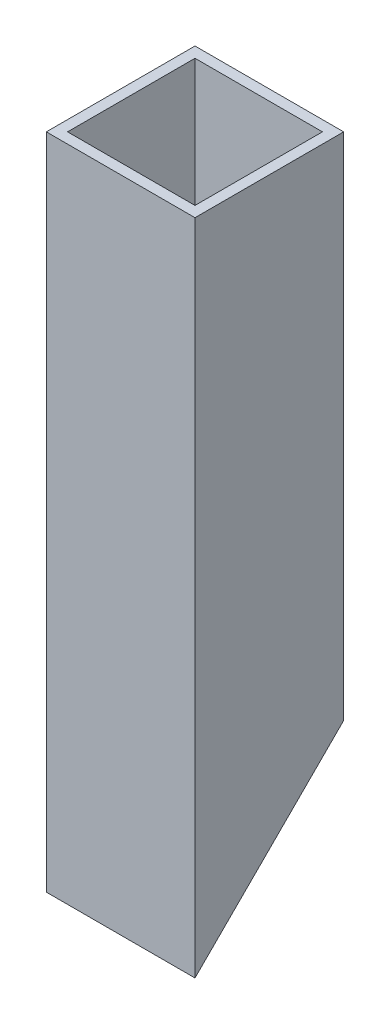
ISO-10303-21;
HEADER;
FILE_DESCRIPTION(('STEP AP214'),'2;1');
FILE_NAME('part.step','',(''),(''),'','','');
FILE_SCHEMA(('AUTOMOTIVE_DESIGN { 1 0 10303 214 1 1 1 1 }'));
ENDSEC;
DATA;
#1=APPLICATION_CONTEXT('core data for automotive mechanical design processes');
#2=APPLICATION_PROTOCOL_DEFINITION('international standard','automotive_design',2000,#1);
#3=PRODUCT_CONTEXT('',#1,'mechanical');
#4=PRODUCT('Part','Part','',(#3));
#5=PRODUCT_RELATED_PRODUCT_CATEGORY('part','',(#4));
#6=PRODUCT_DEFINITION_FORMATION('','',#4);
#7=PRODUCT_DEFINITION_CONTEXT('part definition',#1,'design');
#8=PRODUCT_DEFINITION('design','',#6,#7);
#9=PRODUCT_DEFINITION_SHAPE('','',#8);
#10=(LENGTH_UNIT() NAMED_UNIT(*) SI_UNIT(.MILLI.,.METRE.));
#11=(NAMED_UNIT(*) PLANE_ANGLE_UNIT() SI_UNIT($,.RADIAN.));
#12=(NAMED_UNIT(*) SI_UNIT($,.STERADIAN.) SOLID_ANGLE_UNIT());
#13=UNCERTAINTY_MEASURE_WITH_UNIT(LENGTH_MEASURE(1.E-05),#10,'distance_accuracy_value','');
#14=(GEOMETRIC_REPRESENTATION_CONTEXT(3) GLOBAL_UNCERTAINTY_ASSIGNED_CONTEXT((#13)) GLOBAL_UNIT_ASSIGNED_CONTEXT((#10,
#11,#12)) REPRESENTATION_CONTEXT('',''));
#15=CARTESIAN_POINT('',(0.,0.,0.));
#16=DIRECTION('',(0.,0.,1.));
#17=DIRECTION('',(1.,0.,0.));
#18=AXIS2_PLACEMENT_3D('',#15,#16,#17);
#19=CARTESIAN_POINT('',(0.,196.85,0.));
#20=DIRECTION('',(0.,-1.,0.));
#21=DIRECTION('',(0.,0.,1.));
#22=AXIS2_PLACEMENT_3D('',#19,#20,#21);
#23=PLANE('',#22);
#24=DIRECTION('',(0.,0.,-1.));
#25=VECTOR('',#24,1.);
#26=CARTESIAN_POINT('',(0.,196.85,0.));
#27=LINE('',#26,#25);
#28=CARTESIAN_POINT('',(0.,196.85,44.45));
#29=VERTEX_POINT('',#28);
#30=CARTESIAN_POINT('',(0.,196.85,0.));
#31=VERTEX_POINT('',#30);
#32=EDGE_CURVE('E114',#29,#31,#27,.T.);
#33=ORIENTED_EDGE('',*,*,#32,.F.);
#34=DIRECTION('',(-1.,0.,0.));
#35=VECTOR('',#34,1.);
#36=CARTESIAN_POINT('',(0.,196.85,44.45));
#37=LINE('',#36,#35);
#38=CARTESIAN_POINT('',(44.45,196.85,44.45));
#39=VERTEX_POINT('',#38);
#40=EDGE_CURVE('E123',#39,#29,#37,.T.);
#41=ORIENTED_EDGE('',*,*,#40,.F.);
#42=DIRECTION('',(0.,0.,1.));
#43=VECTOR('',#42,1.);
#44=CARTESIAN_POINT('',(44.45,196.85,0.));
#45=LINE('',#44,#43);
#46=CARTESIAN_POINT('',(44.45,196.85,0.));
#47=VERTEX_POINT('',#46);
#48=EDGE_CURVE('E120',#47,#39,#45,.T.);
#49=ORIENTED_EDGE('',*,*,#48,.F.);
#50=DIRECTION('',(1.,0.,0.));
#51=VECTOR('',#50,1.);
#52=CARTESIAN_POINT('',(0.,196.85,0.));
#53=LINE('',#52,#51);
#54=EDGE_CURVE('E117',#31,#47,#53,.T.);
#55=ORIENTED_EDGE('',*,*,#54,.F.);
#56=EDGE_LOOP('',(#33,#41,#49,#55));
#57=FACE_BOUND('',#56,.T.);
#58=DIRECTION('',(1.,0.,0.));
#59=VECTOR('',#58,1.);
#60=CARTESIAN_POINT('',(3.175,196.85,3.175));
#61=LINE('',#60,#59);
#62=CARTESIAN_POINT('',(3.175,196.85,3.175));
#63=VERTEX_POINT('',#62);
#64=CARTESIAN_POINT('',(41.275,196.85,3.175));
#65=VERTEX_POINT('',#64);
#66=EDGE_CURVE('E98',#63,#65,#61,.T.);
#67=ORIENTED_EDGE('',*,*,#66,.T.);
#68=DIRECTION('',(0.,0.,1.));
#69=VECTOR('',#68,1.);
#70=CARTESIAN_POINT('',(41.275,196.85,3.175));
#71=LINE('',#70,#69);
#72=CARTESIAN_POINT('',(41.275,196.85,41.275));
#73=VERTEX_POINT('',#72);
#74=EDGE_CURVE('E86',#65,#73,#71,.T.);
#75=ORIENTED_EDGE('',*,*,#74,.T.);
#76=DIRECTION('',(-1.,0.,0.));
#77=VECTOR('',#76,1.);
#78=CARTESIAN_POINT('',(3.175,196.85,41.275));
#79=LINE('',#78,#77);
#80=CARTESIAN_POINT('',(3.175,196.85,41.275));
#81=VERTEX_POINT('',#80);
#82=EDGE_CURVE('E109',#73,#81,#79,.T.);
#83=ORIENTED_EDGE('',*,*,#82,.T.);
#84=DIRECTION('',(0.,0.,-1.));
#85=VECTOR('',#84,1.);
#86=CARTESIAN_POINT('',(3.175,196.85,3.175));
#87=LINE('',#86,#85);
#88=EDGE_CURVE('E105',#81,#63,#87,.T.);
#89=ORIENTED_EDGE('',*,*,#88,.T.);
#90=EDGE_LOOP('',(#67,#75,#83,#89));
#91=FACE_BOUND('',#90,.T.);
#92=ADVANCED_FACE('F37',(#57,#91),#23,.F.);
#93=CARTESIAN_POINT('',(0.,196.85,0.));
#94=DIRECTION('',(1.,0.,0.));
#95=DIRECTION('',(0.,0.,1.));
#96=AXIS2_PLACEMENT_3D('',#93,#94,#95);
#97=PLANE('',#96);
#98=DIRECTION('',(0.,-1.,0.));
#99=VECTOR('',#98,1.);
#100=CARTESIAN_POINT('',(0.,196.85,44.45));
#101=LINE('',#100,#99);
#102=CARTESIAN_POINT('',(0.,0.,44.45));
#103=VERTEX_POINT('',#102);
#104=EDGE_CURVE('E126',#29,#103,#101,.T.);
#105=ORIENTED_EDGE('',*,*,#104,.F.);
#106=ORIENTED_EDGE('',*,*,#32,.T.);
#107=DIRECTION('',(0.,-1.,0.));
#108=VECTOR('',#107,1.);
#109=CARTESIAN_POINT('',(0.,196.85,0.));
#110=LINE('',#109,#108);
#111=CARTESIAN_POINT('',(0.,44.45,0.));
#112=VERTEX_POINT('',#111);
#113=EDGE_CURVE('E136',#31,#112,#110,.T.);
#114=ORIENTED_EDGE('',*,*,#113,.T.);
#115=DIRECTION('',(0.,0.707106781186546,-0.707106781186549));
#116=VECTOR('',#115,1.);
#117=CARTESIAN_POINT('',(0.,44.45,0.));
#118=LINE('',#117,#116);
#119=EDGE_CURVE('E11',#103,#112,#118,.T.);
#120=ORIENTED_EDGE('',*,*,#119,.F.);
#121=EDGE_LOOP('',(#105,#106,#114,#120));
#122=FACE_BOUND('',#121,.T.);
#123=ADVANCED_FACE('F172',(#122),#97,.F.);
#124=CARTESIAN_POINT('',(0.,196.85,0.));
#125=DIRECTION('',(0.,0.,1.));
#126=DIRECTION('',(-1.,0.,0.));
#127=AXIS2_PLACEMENT_3D('',#124,#125,#126);
#128=PLANE('',#127);
#129=ORIENTED_EDGE('',*,*,#113,.F.);
#130=ORIENTED_EDGE('',*,*,#54,.T.);
#131=DIRECTION('',(0.,-1.,0.));
#132=VECTOR('',#131,1.);
#133=CARTESIAN_POINT('',(44.45,196.85,0.));
#134=LINE('',#133,#132);
#135=CARTESIAN_POINT('',(44.45,44.45,0.));
#136=VERTEX_POINT('',#135);
#137=EDGE_CURVE('E134',#47,#136,#134,.T.);
#138=ORIENTED_EDGE('',*,*,#137,.T.);
#139=DIRECTION('',(1.,0.,0.));
#140=VECTOR('',#139,1.);
#141=CARTESIAN_POINT('',(44.45,44.45,0.));
#142=LINE('',#141,#140);
#143=EDGE_CURVE('E56',#112,#136,#142,.T.);
#144=ORIENTED_EDGE('',*,*,#143,.F.);
#145=EDGE_LOOP('',(#129,#130,#138,#144));
#146=FACE_BOUND('',#145,.T.);
#147=ADVANCED_FACE('F180',(#146),#128,.F.);
#148=CARTESIAN_POINT('',(44.45,196.85,0.));
#149=DIRECTION('',(-1.,0.,0.));
#150=DIRECTION('',(0.,0.,-1.));
#151=AXIS2_PLACEMENT_3D('',#148,#149,#150);
#152=PLANE('',#151);
#153=ORIENTED_EDGE('',*,*,#137,.F.);
#154=ORIENTED_EDGE('',*,*,#48,.T.);
#155=DIRECTION('',(0.,-1.,0.));
#156=VECTOR('',#155,1.);
#157=CARTESIAN_POINT('',(44.45,196.85,44.45));
#158=LINE('',#157,#156);
#159=CARTESIAN_POINT('',(44.45,0.,44.45));
#160=VERTEX_POINT('',#159);
#161=EDGE_CURVE('E131',#39,#160,#158,.T.);
#162=ORIENTED_EDGE('',*,*,#161,.T.);
#163=DIRECTION('',(0.,-0.707106781186546,0.707106781186549));
#164=VECTOR('',#163,1.);
#165=CARTESIAN_POINT('',(44.45,44.45,0.));
#166=LINE('',#165,#164);
#167=EDGE_CURVE('E47',#136,#160,#166,.T.);
#168=ORIENTED_EDGE('',*,*,#167,.F.);
#169=EDGE_LOOP('',(#153,#154,#162,#168));
#170=FACE_BOUND('',#169,.T.);
#171=ADVANCED_FACE('F182',(#170),#152,.F.);
#172=CARTESIAN_POINT('',(0.,196.85,44.45));
#173=DIRECTION('',(0.,0.,-1.));
#174=DIRECTION('',(1.,0.,0.));
#175=AXIS2_PLACEMENT_3D('',#172,#173,#174);
#176=PLANE('',#175);
#177=DIRECTION('',(-1.,0.,0.));
#178=VECTOR('',#177,1.);
#179=CARTESIAN_POINT('',(0.,0.,44.45));
#180=LINE('',#179,#178);
#181=EDGE_CURVE('E90',#160,#103,#180,.T.);
#182=ORIENTED_EDGE('',*,*,#181,.F.);
#183=ORIENTED_EDGE('',*,*,#161,.F.);
#184=ORIENTED_EDGE('',*,*,#40,.T.);
#185=ORIENTED_EDGE('',*,*,#104,.T.);
#186=EDGE_LOOP('',(#182,#183,#184,#185));
#187=FACE_BOUND('',#186,.T.);
#188=ADVANCED_FACE('F173',(#187),#176,.F.);
#189=CARTESIAN_POINT('',(3.175,196.85,3.175));
#190=DIRECTION('',(0.,0.,1.));
#191=DIRECTION('',(-1.,0.,0.));
#192=AXIS2_PLACEMENT_3D('',#189,#190,#191);
#193=PLANE('',#192);
#194=DIRECTION('',(1.,0.,0.));
#195=VECTOR('',#194,1.);
#196=CARTESIAN_POINT('',(0.,41.275,3.175));
#197=LINE('',#196,#195);
#198=CARTESIAN_POINT('',(3.175,41.275,3.175));
#199=VERTEX_POINT('',#198);
#200=CARTESIAN_POINT('',(41.275,41.275,3.175));
#201=VERTEX_POINT('',#200);
#202=EDGE_CURVE('E41',#199,#201,#197,.T.);
#203=ORIENTED_EDGE('',*,*,#202,.T.);
#204=DIRECTION('',(0.,-1.,0.));
#205=VECTOR('',#204,1.);
#206=CARTESIAN_POINT('',(41.275,196.85,3.175));
#207=LINE('',#206,#205);
#208=EDGE_CURVE('E83',#65,#201,#207,.T.);
#209=ORIENTED_EDGE('',*,*,#208,.F.);
#210=ORIENTED_EDGE('',*,*,#66,.F.);
#211=DIRECTION('',(0.,-1.,0.));
#212=VECTOR('',#211,1.);
#213=CARTESIAN_POINT('',(3.175,196.85,3.175));
#214=LINE('',#213,#212);
#215=EDGE_CURVE('E96',#63,#199,#214,.T.);
#216=ORIENTED_EDGE('',*,*,#215,.T.);
#217=EDGE_LOOP('',(#203,#209,#210,#216));
#218=FACE_BOUND('',#217,.T.);
#219=ADVANCED_FACE('F94',(#218),#193,.T.);
#220=CARTESIAN_POINT('',(41.275,196.85,3.175));
#221=DIRECTION('',(-1.,0.,0.));
#222=DIRECTION('',(0.,0.,-1.));
#223=AXIS2_PLACEMENT_3D('',#220,#221,#222);
#224=PLANE('',#223);
#225=DIRECTION('',(0.,-0.707106781186546,0.707106781186549));
#226=VECTOR('',#225,1.);
#227=CARTESIAN_POINT('',(41.275,44.45,0.));
#228=LINE('',#227,#226);
#229=CARTESIAN_POINT('',(41.275,3.17500000000018,41.275));
#230=VERTEX_POINT('',#229);
#231=EDGE_CURVE('E73',#201,#230,#228,.T.);
#232=ORIENTED_EDGE('',*,*,#231,.T.);
#233=DIRECTION('',(0.,-1.,0.));
#234=VECTOR('',#233,1.);
#235=CARTESIAN_POINT('',(41.275,196.85,41.275));
#236=LINE('',#235,#234);
#237=EDGE_CURVE('E91',#73,#230,#236,.T.);
#238=ORIENTED_EDGE('',*,*,#237,.F.);
#239=ORIENTED_EDGE('',*,*,#74,.F.);
#240=ORIENTED_EDGE('',*,*,#208,.T.);
#241=EDGE_LOOP('',(#232,#238,#239,#240));
#242=FACE_BOUND('',#241,.T.);
#243=ADVANCED_FACE('F84',(#242),#224,.T.);
#244=CARTESIAN_POINT('',(3.175,196.85,41.275));
#245=DIRECTION('',(0.,0.,-1.));
#246=DIRECTION('',(1.,0.,0.));
#247=AXIS2_PLACEMENT_3D('',#244,#245,#246);
#248=PLANE('',#247);
#249=DIRECTION('',(-1.,0.,0.));
#250=VECTOR('',#249,1.);
#251=CARTESIAN_POINT('',(0.,3.17500000000015,41.275));
#252=LINE('',#251,#250);
#253=CARTESIAN_POINT('',(3.175,3.17500000000018,41.275));
#254=VERTEX_POINT('',#253);
#255=EDGE_CURVE('E77',#230,#254,#252,.T.);
#256=ORIENTED_EDGE('',*,*,#255,.T.);
#257=DIRECTION('',(0.,-1.,0.));
#258=VECTOR('',#257,1.);
#259=CARTESIAN_POINT('',(3.175,196.85,41.275));
#260=LINE('',#259,#258);
#261=EDGE_CURVE('E104',#81,#254,#260,.T.);
#262=ORIENTED_EDGE('',*,*,#261,.F.);
#263=ORIENTED_EDGE('',*,*,#82,.F.);
#264=ORIENTED_EDGE('',*,*,#237,.T.);
#265=EDGE_LOOP('',(#256,#262,#263,#264));
#266=FACE_BOUND('',#265,.T.);
#267=ADVANCED_FACE('F146',(#266),#248,.T.);
#268=CARTESIAN_POINT('',(3.175,196.85,3.175));
#269=DIRECTION('',(1.,0.,0.));
#270=DIRECTION('',(0.,0.,1.));
#271=AXIS2_PLACEMENT_3D('',#268,#269,#270);
#272=PLANE('',#271);
#273=DIRECTION('',(0.,0.707106781186546,-0.707106781186549));
#274=VECTOR('',#273,1.);
#275=CARTESIAN_POINT('',(3.175,44.45,0.));
#276=LINE('',#275,#274);
#277=EDGE_CURVE('E142',#254,#199,#276,.T.);
#278=ORIENTED_EDGE('',*,*,#277,.T.);
#279=ORIENTED_EDGE('',*,*,#215,.F.);
#280=ORIENTED_EDGE('',*,*,#88,.F.);
#281=ORIENTED_EDGE('',*,*,#261,.T.);
#282=EDGE_LOOP('',(#278,#279,#280,#281));
#283=FACE_BOUND('',#282,.T.);
#284=ADVANCED_FACE('F203',(#283),#272,.T.);
#285=CARTESIAN_POINT('',(0.,44.45,0.));
#286=DIRECTION('',(0.,-0.707106781186549,-0.707106781186546));
#287=DIRECTION('',(-1.,0.,0.));
#288=AXIS2_PLACEMENT_3D('',#285,#286,#287);
#289=PLANE('',#288);
#290=ORIENTED_EDGE('',*,*,#119,.T.);
#291=ORIENTED_EDGE('',*,*,#143,.T.);
#292=ORIENTED_EDGE('',*,*,#167,.T.);
#293=ORIENTED_EDGE('',*,*,#181,.T.);
#294=EDGE_LOOP('',(#290,#291,#292,#293));
#295=FACE_BOUND('',#294,.T.);
#296=ORIENTED_EDGE('',*,*,#277,.F.);
#297=ORIENTED_EDGE('',*,*,#255,.F.);
#298=ORIENTED_EDGE('',*,*,#231,.F.);
#299=ORIENTED_EDGE('',*,*,#202,.F.);
#300=EDGE_LOOP('',(#296,#297,#298,#299));
#301=FACE_BOUND('',#300,.T.);
#302=ADVANCED_FACE('F39',(#295,#301),#289,.T.);
#303=CLOSED_SHELL('',(#92,#123,#147,#171,#188,#219,#243,#267,#284,#302));
#304=MANIFOLD_SOLID_BREP('B2',#303);
#305=ADVANCED_BREP_SHAPE_REPRESENTATION('',(#18,#304),#14);
#306=SHAPE_DEFINITION_REPRESENTATION(#9,#305);
ENDSEC;
END-ISO-10303-21;
